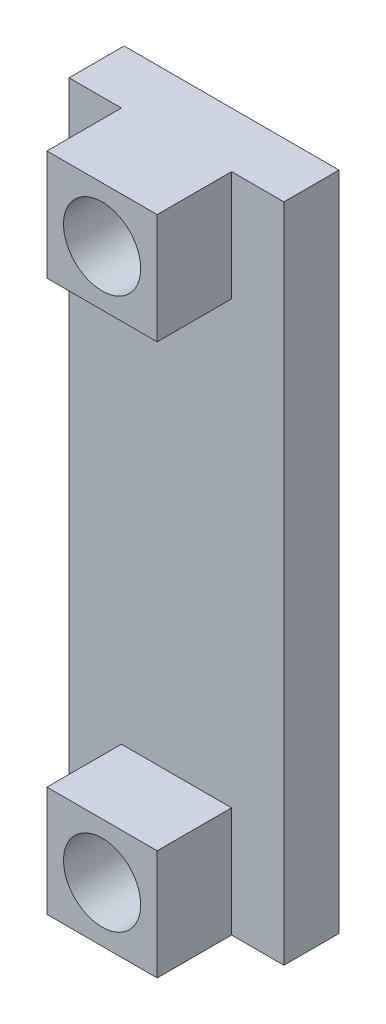
ISO-10303-21;
HEADER;
FILE_DESCRIPTION(('STEP AP214'),'2;1');
FILE_NAME('part.step','',(''),(''),'','','');
FILE_SCHEMA(('AUTOMOTIVE_DESIGN { 1 0 10303 214 1 1 1 1 }'));
ENDSEC;
DATA;
#1=APPLICATION_CONTEXT('core data for automotive mechanical design processes');
#2=APPLICATION_PROTOCOL_DEFINITION('international standard','automotive_design',2000,#1);
#3=PRODUCT_CONTEXT('',#1,'mechanical');
#4=PRODUCT('Part','Part','',(#3));
#5=PRODUCT_RELATED_PRODUCT_CATEGORY('part','',(#4));
#6=PRODUCT_DEFINITION_FORMATION('','',#4);
#7=PRODUCT_DEFINITION_CONTEXT('part definition',#1,'design');
#8=PRODUCT_DEFINITION('design','',#6,#7);
#9=PRODUCT_DEFINITION_SHAPE('','',#8);
#10=(LENGTH_UNIT() NAMED_UNIT(*) SI_UNIT(.MILLI.,.METRE.));
#11=(NAMED_UNIT(*) PLANE_ANGLE_UNIT() SI_UNIT($,.RADIAN.));
#12=(NAMED_UNIT(*) SI_UNIT($,.STERADIAN.) SOLID_ANGLE_UNIT());
#13=UNCERTAINTY_MEASURE_WITH_UNIT(LENGTH_MEASURE(1.E-05),#10,'distance_accuracy_value','');
#14=(GEOMETRIC_REPRESENTATION_CONTEXT(3) GLOBAL_UNCERTAINTY_ASSIGNED_CONTEXT((#13)) GLOBAL_UNIT_ASSIGNED_CONTEXT((#10,
#11,#12)) REPRESENTATION_CONTEXT('',''));
#15=CARTESIAN_POINT('',(0.,0.,0.));
#16=DIRECTION('',(0.,0.,1.));
#17=DIRECTION('',(1.,0.,0.));
#18=AXIS2_PLACEMENT_3D('',#15,#16,#17);
#19=CARTESIAN_POINT('',(0.,0.,2.54));
#20=DIRECTION('',(0.,0.,-1.));
#21=DIRECTION('',(-1.,0.,0.));
#22=AXIS2_PLACEMENT_3D('',#19,#20,#21);
#23=PLANE('',#22);
#24=DIRECTION('',(0.,-1.,0.));
#25=VECTOR('',#24,1.);
#26=CARTESIAN_POINT('',(-7.493,-30.48,2.54));
#27=LINE('',#26,#25);
#28=CARTESIAN_POINT('',(-7.493,-25.4,2.54));
#29=VERTEX_POINT('',#28);
#30=CARTESIAN_POINT('',(-7.493,-30.48,2.54));
#31=VERTEX_POINT('',#30);
#32=EDGE_CURVE('E50',#29,#31,#27,.T.);
#33=ORIENTED_EDGE('',*,*,#32,.F.);
#34=DIRECTION('',(-1.,0.,0.));
#35=VECTOR('',#34,1.);
#36=CARTESIAN_POINT('',(-7.493,-25.4,2.54));
#37=LINE('',#36,#35);
#38=CARTESIAN_POINT('',(-2.413,-25.4,2.54));
#39=VERTEX_POINT('',#38);
#40=EDGE_CURVE('E54',#39,#29,#37,.T.);
#41=ORIENTED_EDGE('',*,*,#40,.F.);
#42=DIRECTION('',(0.,1.,0.));
#43=VECTOR('',#42,1.);
#44=CARTESIAN_POINT('',(-2.413,-30.48,2.54));
#45=LINE('',#44,#43);
#46=CARTESIAN_POINT('',(-2.413,-30.48,2.54));
#47=VERTEX_POINT('',#46);
#48=EDGE_CURVE('E222',#47,#39,#45,.T.);
#49=ORIENTED_EDGE('',*,*,#48,.F.);
#50=DIRECTION('',(1.,0.,0.));
#51=VECTOR('',#50,1.);
#52=CARTESIAN_POINT('',(0.,-30.48,2.54));
#53=LINE('',#52,#51);
#54=CARTESIAN_POINT('',(0.,-30.48,2.54));
#55=VERTEX_POINT('',#54);
#56=EDGE_CURVE('E190',#47,#55,#53,.T.);
#57=ORIENTED_EDGE('',*,*,#56,.T.);
#58=DIRECTION('',(0.,1.,0.));
#59=VECTOR('',#58,1.);
#60=CARTESIAN_POINT('',(0.,0.,2.54));
#61=LINE('',#60,#59);
#62=CARTESIAN_POINT('',(0.,0.,2.54));
#63=VERTEX_POINT('',#62);
#64=EDGE_CURVE('E181',#55,#63,#61,.T.);
#65=ORIENTED_EDGE('',*,*,#64,.T.);
#66=DIRECTION('',(-1.,0.,0.));
#67=VECTOR('',#66,1.);
#68=CARTESIAN_POINT('',(0.,0.,2.54));
#69=LINE('',#68,#67);
#70=CARTESIAN_POINT('',(-2.413,0.,2.54));
#71=VERTEX_POINT('',#70);
#72=EDGE_CURVE('E186',#63,#71,#69,.T.);
#73=ORIENTED_EDGE('',*,*,#72,.T.);
#74=DIRECTION('',(0.,1.,0.));
#75=VECTOR('',#74,1.);
#76=CARTESIAN_POINT('',(-2.413,0.,2.54));
#77=LINE('',#76,#75);
#78=CARTESIAN_POINT('',(-2.413,-5.08,2.54));
#79=VERTEX_POINT('',#78);
#80=EDGE_CURVE('E158',#79,#71,#77,.T.);
#81=ORIENTED_EDGE('',*,*,#80,.F.);
#82=DIRECTION('',(1.,0.,0.));
#83=VECTOR('',#82,1.);
#84=CARTESIAN_POINT('',(-7.493,-5.08,2.54));
#85=LINE('',#84,#83);
#86=CARTESIAN_POINT('',(-7.493,-5.08,2.54));
#87=VERTEX_POINT('',#86);
#88=EDGE_CURVE('E148',#87,#79,#85,.T.);
#89=ORIENTED_EDGE('',*,*,#88,.F.);
#90=DIRECTION('',(0.,-1.,0.));
#91=VECTOR('',#90,1.);
#92=CARTESIAN_POINT('',(-7.493,0.,2.54));
#93=LINE('',#92,#91);
#94=CARTESIAN_POINT('',(-7.493,0.,2.54));
#95=VERTEX_POINT('',#94);
#96=EDGE_CURVE('E145',#95,#87,#93,.T.);
#97=ORIENTED_EDGE('',*,*,#96,.F.);
#98=CARTESIAN_POINT('',(-9.906,0.,2.54));
#99=VERTEX_POINT('',#98);
#100=EDGE_CURVE('E184',#95,#99,#69,.T.);
#101=ORIENTED_EDGE('',*,*,#100,.T.);
#102=DIRECTION('',(0.,-1.,0.));
#103=VECTOR('',#102,1.);
#104=CARTESIAN_POINT('',(-9.906,0.,2.54));
#105=LINE('',#104,#103);
#106=CARTESIAN_POINT('',(-9.906,-30.48,2.54));
#107=VERTEX_POINT('',#106);
#108=EDGE_CURVE('E188',#99,#107,#105,.T.);
#109=ORIENTED_EDGE('',*,*,#108,.T.);
#110=EDGE_CURVE('E191',#107,#31,#53,.T.);
#111=ORIENTED_EDGE('',*,*,#110,.T.);
#112=EDGE_LOOP('',(#33,#41,#49,#57,#65,#73,#81,#89,#97,#101,#109,#111));
#113=FACE_BOUND('',#112,.T.);
#114=ADVANCED_FACE('F35',(#113),#23,.F.);
#115=CARTESIAN_POINT('',(0.,0.,2.54));
#116=DIRECTION('',(-1.,0.,0.));
#117=DIRECTION('',(0.,-1.,0.));
#118=AXIS2_PLACEMENT_3D('',#115,#116,#117);
#119=PLANE('',#118);
#120=DIRECTION('',(0.,1.,0.));
#121=VECTOR('',#120,1.);
#122=CARTESIAN_POINT('',(0.,0.,0.));
#123=LINE('',#122,#121);
#124=CARTESIAN_POINT('',(0.,-30.48,0.));
#125=VERTEX_POINT('',#124);
#126=CARTESIAN_POINT('',(0.,0.,0.));
#127=VERTEX_POINT('',#126);
#128=EDGE_CURVE('E180',#125,#127,#123,.T.);
#129=ORIENTED_EDGE('',*,*,#128,.T.);
#130=DIRECTION('',(0.,0.,-1.));
#131=VECTOR('',#130,1.);
#132=CARTESIAN_POINT('',(0.,0.,2.54));
#133=LINE('',#132,#131);
#134=EDGE_CURVE('E11',#63,#127,#133,.T.);
#135=ORIENTED_EDGE('',*,*,#134,.F.);
#136=ORIENTED_EDGE('',*,*,#64,.F.);
#137=DIRECTION('',(0.,0.,-1.));
#138=VECTOR('',#137,1.);
#139=CARTESIAN_POINT('',(0.,-30.48,2.54));
#140=LINE('',#139,#138);
#141=EDGE_CURVE('E193',#55,#125,#140,.T.);
#142=ORIENTED_EDGE('',*,*,#141,.T.);
#143=EDGE_LOOP('',(#129,#135,#136,#142));
#144=FACE_BOUND('',#143,.T.);
#145=ADVANCED_FACE('F37',(#144),#119,.F.);
#146=CARTESIAN_POINT('',(0.,0.,2.54));
#147=DIRECTION('',(0.,-1.,0.));
#148=DIRECTION('',(0.,0.,-1.));
#149=AXIS2_PLACEMENT_3D('',#146,#147,#148);
#150=PLANE('',#149);
#151=DIRECTION('',(-1.,0.,0.));
#152=VECTOR('',#151,1.);
#153=CARTESIAN_POINT('',(0.,0.,0.));
#154=LINE('',#153,#152);
#155=CARTESIAN_POINT('',(-9.906,0.,0.));
#156=VERTEX_POINT('',#155);
#157=EDGE_CURVE('E196',#127,#156,#154,.T.);
#158=ORIENTED_EDGE('',*,*,#157,.T.);
#159=DIRECTION('',(0.,0.,-1.));
#160=VECTOR('',#159,1.);
#161=CARTESIAN_POINT('',(-9.906,0.,2.54));
#162=LINE('',#161,#160);
#163=EDGE_CURVE('E43',#99,#156,#162,.T.);
#164=ORIENTED_EDGE('',*,*,#163,.F.);
#165=ORIENTED_EDGE('',*,*,#100,.F.);
#166=DIRECTION('',(0.,0.,-1.));
#167=VECTOR('',#166,1.);
#168=CARTESIAN_POINT('',(-7.493,0.,5.969));
#169=LINE('',#168,#167);
#170=CARTESIAN_POINT('',(-7.493,0.,5.969));
#171=VERTEX_POINT('',#170);
#172=EDGE_CURVE('E163',#171,#95,#169,.T.);
#173=ORIENTED_EDGE('',*,*,#172,.F.);
#174=DIRECTION('',(-1.,0.,0.));
#175=VECTOR('',#174,1.);
#176=CARTESIAN_POINT('',(-7.493,0.,5.969));
#177=LINE('',#176,#175);
#178=CARTESIAN_POINT('',(-2.413,0.,5.969));
#179=VERTEX_POINT('',#178);
#180=EDGE_CURVE('E162',#179,#171,#177,.T.);
#181=ORIENTED_EDGE('',*,*,#180,.F.);
#182=DIRECTION('',(0.,0.,-1.));
#183=VECTOR('',#182,1.);
#184=CARTESIAN_POINT('',(-2.413,0.,5.969));
#185=LINE('',#184,#183);
#186=EDGE_CURVE('E171',#179,#71,#185,.T.);
#187=ORIENTED_EDGE('',*,*,#186,.T.);
#188=ORIENTED_EDGE('',*,*,#72,.F.);
#189=ORIENTED_EDGE('',*,*,#134,.T.);
#190=EDGE_LOOP('',(#158,#164,#165,#173,#181,#187,#188,#189));
#191=FACE_BOUND('',#190,.T.);
#192=ADVANCED_FACE('F252',(#191),#150,.F.);
#193=CARTESIAN_POINT('',(-9.906,0.,2.54));
#194=DIRECTION('',(1.,0.,0.));
#195=DIRECTION('',(0.,0.,-1.));
#196=AXIS2_PLACEMENT_3D('',#193,#194,#195);
#197=PLANE('',#196);
#198=DIRECTION('',(0.,-1.,0.));
#199=VECTOR('',#198,1.);
#200=CARTESIAN_POINT('',(-9.906,0.,0.));
#201=LINE('',#200,#199);
#202=CARTESIAN_POINT('',(-9.906,-30.48,0.));
#203=VERTEX_POINT('',#202);
#204=EDGE_CURVE('E198',#156,#203,#201,.T.);
#205=ORIENTED_EDGE('',*,*,#204,.T.);
#206=DIRECTION('',(0.,0.,-1.));
#207=VECTOR('',#206,1.);
#208=CARTESIAN_POINT('',(-9.906,-30.48,2.54));
#209=LINE('',#208,#207);
#210=EDGE_CURVE('E203',#107,#203,#209,.T.);
#211=ORIENTED_EDGE('',*,*,#210,.F.);
#212=ORIENTED_EDGE('',*,*,#108,.F.);
#213=ORIENTED_EDGE('',*,*,#163,.T.);
#214=EDGE_LOOP('',(#205,#211,#212,#213));
#215=FACE_BOUND('',#214,.T.);
#216=ADVANCED_FACE('F210',(#215),#197,.F.);
#217=CARTESIAN_POINT('',(0.,-30.48,2.54));
#218=DIRECTION('',(0.,1.,0.));
#219=DIRECTION('',(-1.,0.,0.));
#220=AXIS2_PLACEMENT_3D('',#217,#218,#219);
#221=PLANE('',#220);
#222=DIRECTION('',(1.,0.,0.));
#223=VECTOR('',#222,1.);
#224=CARTESIAN_POINT('',(0.,-30.48,0.));
#225=LINE('',#224,#223);
#226=EDGE_CURVE('E185',#203,#125,#225,.T.);
#227=ORIENTED_EDGE('',*,*,#226,.T.);
#228=ORIENTED_EDGE('',*,*,#141,.F.);
#229=ORIENTED_EDGE('',*,*,#56,.F.);
#230=DIRECTION('',(0.,0.,-1.));
#231=VECTOR('',#230,1.);
#232=CARTESIAN_POINT('',(-2.413,-30.48,5.969));
#233=LINE('',#232,#231);
#234=CARTESIAN_POINT('',(-2.413,-30.48,5.969));
#235=VERTEX_POINT('',#234);
#236=EDGE_CURVE('E130',#235,#47,#233,.T.);
#237=ORIENTED_EDGE('',*,*,#236,.F.);
#238=DIRECTION('',(1.,0.,0.));
#239=VECTOR('',#238,1.);
#240=CARTESIAN_POINT('',(-7.493,-30.48,5.969));
#241=LINE('',#240,#239);
#242=CARTESIAN_POINT('',(-7.493,-30.48,5.969));
#243=VERTEX_POINT('',#242);
#244=EDGE_CURVE('E123',#243,#235,#241,.T.);
#245=ORIENTED_EDGE('',*,*,#244,.F.);
#246=DIRECTION('',(0.,0.,-1.));
#247=VECTOR('',#246,1.);
#248=CARTESIAN_POINT('',(-7.493,-30.48,5.969));
#249=LINE('',#248,#247);
#250=EDGE_CURVE('E128',#243,#31,#249,.T.);
#251=ORIENTED_EDGE('',*,*,#250,.T.);
#252=ORIENTED_EDGE('',*,*,#110,.F.);
#253=ORIENTED_EDGE('',*,*,#210,.T.);
#254=EDGE_LOOP('',(#227,#228,#229,#237,#245,#251,#252,#253));
#255=FACE_BOUND('',#254,.T.);
#256=ADVANCED_FACE('F125',(#255),#221,.F.);
#257=CARTESIAN_POINT('',(0.,0.,0.));
#258=DIRECTION('',(0.,0.,-1.));
#259=DIRECTION('',(-1.,0.,0.));
#260=AXIS2_PLACEMENT_3D('',#257,#258,#259);
#261=PLANE('',#260);
#262=CARTESIAN_POINT('',(-4.953,-27.94,0.));
#263=DIRECTION('',(0.,0.,-1.));
#264=DIRECTION('',(-1.,0.,0.));
#265=AXIS2_PLACEMENT_3D('',#262,#263,#264);
#266=CIRCLE('',#265,1.778);
#267=CARTESIAN_POINT('',(-6.731,-27.94,0.));
#268=VERTEX_POINT('',#267);
#269=EDGE_CURVE('E393',#268,#268,#266,.T.);
#270=ORIENTED_EDGE('',*,*,#269,.F.);
#271=EDGE_LOOP('',(#270));
#272=FACE_BOUND('',#271,.T.);
#273=CARTESIAN_POINT('',(-4.953,-2.54,0.));
#274=DIRECTION('',(0.,0.,-1.));
#275=DIRECTION('',(-1.,0.,0.));
#276=AXIS2_PLACEMENT_3D('',#273,#274,#275);
#277=CIRCLE('',#276,1.778);
#278=CARTESIAN_POINT('',(-6.731,-2.54,0.));
#279=VERTEX_POINT('',#278);
#280=EDGE_CURVE('E232',#279,#279,#277,.T.);
#281=ORIENTED_EDGE('',*,*,#280,.F.);
#282=EDGE_LOOP('',(#281));
#283=FACE_BOUND('',#282,.T.);
#284=ORIENTED_EDGE('',*,*,#128,.F.);
#285=ORIENTED_EDGE('',*,*,#226,.F.);
#286=ORIENTED_EDGE('',*,*,#204,.F.);
#287=ORIENTED_EDGE('',*,*,#157,.F.);
#288=EDGE_LOOP('',(#284,#285,#286,#287));
#289=FACE_BOUND('',#288,.T.);
#290=ADVANCED_FACE('F217',(#272,#283,#289),#261,.T.);
#291=CARTESIAN_POINT('',(-7.493,0.,5.969));
#292=DIRECTION('',(1.,0.,0.));
#293=DIRECTION('',(0.,1.,0.));
#294=AXIS2_PLACEMENT_3D('',#291,#292,#293);
#295=PLANE('',#294);
#296=ORIENTED_EDGE('',*,*,#96,.T.);
#297=DIRECTION('',(0.,0.,-1.));
#298=VECTOR('',#297,1.);
#299=CARTESIAN_POINT('',(-7.493,-5.08,5.969));
#300=LINE('',#299,#298);
#301=CARTESIAN_POINT('',(-7.493,-5.08,5.969));
#302=VERTEX_POINT('',#301);
#303=EDGE_CURVE('E177',#302,#87,#300,.T.);
#304=ORIENTED_EDGE('',*,*,#303,.F.);
#305=DIRECTION('',(0.,-1.,0.));
#306=VECTOR('',#305,1.);
#307=CARTESIAN_POINT('',(-7.493,0.,5.969));
#308=LINE('',#307,#306);
#309=EDGE_CURVE('E154',#171,#302,#308,.T.);
#310=ORIENTED_EDGE('',*,*,#309,.F.);
#311=ORIENTED_EDGE('',*,*,#172,.T.);
#312=EDGE_LOOP('',(#296,#304,#310,#311));
#313=FACE_BOUND('',#312,.T.);
#314=ADVANCED_FACE('F255',(#313),#295,.F.);
#315=CARTESIAN_POINT('',(-7.493,-5.08,5.969));
#316=DIRECTION('',(0.,1.,0.));
#317=DIRECTION('',(0.,0.,1.));
#318=AXIS2_PLACEMENT_3D('',#315,#316,#317);
#319=PLANE('',#318);
#320=ORIENTED_EDGE('',*,*,#88,.T.);
#321=DIRECTION('',(0.,0.,-1.));
#322=VECTOR('',#321,1.);
#323=CARTESIAN_POINT('',(-2.413,-5.08,5.969));
#324=LINE('',#323,#322);
#325=CARTESIAN_POINT('',(-2.413,-5.08,5.969));
#326=VERTEX_POINT('',#325);
#327=EDGE_CURVE('E174',#326,#79,#324,.T.);
#328=ORIENTED_EDGE('',*,*,#327,.F.);
#329=DIRECTION('',(1.,0.,0.));
#330=VECTOR('',#329,1.);
#331=CARTESIAN_POINT('',(-7.493,-5.08,5.969));
#332=LINE('',#331,#330);
#333=EDGE_CURVE('E157',#302,#326,#332,.T.);
#334=ORIENTED_EDGE('',*,*,#333,.F.);
#335=ORIENTED_EDGE('',*,*,#303,.T.);
#336=EDGE_LOOP('',(#320,#328,#334,#335));
#337=FACE_BOUND('',#336,.T.);
#338=ADVANCED_FACE('F274',(#337),#319,.F.);
#339=CARTESIAN_POINT('',(-2.413,0.,5.969));
#340=DIRECTION('',(-1.,0.,0.));
#341=DIRECTION('',(0.,-1.,0.));
#342=AXIS2_PLACEMENT_3D('',#339,#340,#341);
#343=PLANE('',#342);
#344=ORIENTED_EDGE('',*,*,#80,.T.);
#345=ORIENTED_EDGE('',*,*,#186,.F.);
#346=DIRECTION('',(0.,1.,0.));
#347=VECTOR('',#346,1.);
#348=CARTESIAN_POINT('',(-2.413,0.,5.969));
#349=LINE('',#348,#347);
#350=EDGE_CURVE('E160',#326,#179,#349,.T.);
#351=ORIENTED_EDGE('',*,*,#350,.F.);
#352=ORIENTED_EDGE('',*,*,#327,.T.);
#353=EDGE_LOOP('',(#344,#345,#351,#352));
#354=FACE_BOUND('',#353,.T.);
#355=ADVANCED_FACE('F271',(#354),#343,.F.);
#356=CARTESIAN_POINT('',(0.,0.,5.969));
#357=DIRECTION('',(0.,0.,1.));
#358=DIRECTION('',(1.,0.,0.));
#359=AXIS2_PLACEMENT_3D('',#356,#357,#358);
#360=PLANE('',#359);
#361=CARTESIAN_POINT('',(-4.953,-2.54,5.969));
#362=DIRECTION('',(0.,0.,1.));
#363=DIRECTION('',(1.,0.,0.));
#364=AXIS2_PLACEMENT_3D('',#361,#362,#363);
#365=CIRCLE('',#364,1.778);
#366=CARTESIAN_POINT('',(-3.175,-2.54,5.969));
#367=VERTEX_POINT('',#366);
#368=EDGE_CURVE('E389',#367,#367,#365,.T.);
#369=ORIENTED_EDGE('',*,*,#368,.F.);
#370=EDGE_LOOP('',(#369));
#371=FACE_BOUND('',#370,.T.);
#372=ORIENTED_EDGE('',*,*,#309,.T.);
#373=ORIENTED_EDGE('',*,*,#333,.T.);
#374=ORIENTED_EDGE('',*,*,#350,.T.);
#375=ORIENTED_EDGE('',*,*,#180,.T.);
#376=EDGE_LOOP('',(#372,#373,#374,#375));
#377=FACE_BOUND('',#376,.T.);
#378=ADVANCED_FACE('F279',(#371,#377),#360,.T.);
#379=CARTESIAN_POINT('',(-7.493,-30.48,5.969));
#380=DIRECTION('',(1.,0.,0.));
#381=DIRECTION('',(0.,0.,-1.));
#382=AXIS2_PLACEMENT_3D('',#379,#380,#381);
#383=PLANE('',#382);
#384=ORIENTED_EDGE('',*,*,#32,.T.);
#385=ORIENTED_EDGE('',*,*,#250,.F.);
#386=DIRECTION('',(0.,-1.,0.));
#387=VECTOR('',#386,1.);
#388=CARTESIAN_POINT('',(-7.493,-30.48,5.969));
#389=LINE('',#388,#387);
#390=CARTESIAN_POINT('',(-7.493,-25.4,5.969));
#391=VERTEX_POINT('',#390);
#392=EDGE_CURVE('E134',#391,#243,#389,.T.);
#393=ORIENTED_EDGE('',*,*,#392,.F.);
#394=DIRECTION('',(0.,0.,-1.));
#395=VECTOR('',#394,1.);
#396=CARTESIAN_POINT('',(-7.493,-25.4,5.969));
#397=LINE('',#396,#395);
#398=EDGE_CURVE('E229',#391,#29,#397,.T.);
#399=ORIENTED_EDGE('',*,*,#398,.T.);
#400=EDGE_LOOP('',(#384,#385,#393,#399));
#401=FACE_BOUND('',#400,.T.);
#402=ADVANCED_FACE('F144',(#401),#383,.F.);
#403=CARTESIAN_POINT('',(-2.413,-30.48,5.969));
#404=DIRECTION('',(-1.,0.,0.));
#405=DIRECTION('',(0.,0.,1.));
#406=AXIS2_PLACEMENT_3D('',#403,#404,#405);
#407=PLANE('',#406);
#408=ORIENTED_EDGE('',*,*,#48,.T.);
#409=DIRECTION('',(0.,0.,-1.));
#410=VECTOR('',#409,1.);
#411=CARTESIAN_POINT('',(-2.413,-25.4,5.969));
#412=LINE('',#411,#410);
#413=CARTESIAN_POINT('',(-2.413,-25.4,5.969));
#414=VERTEX_POINT('',#413);
#415=EDGE_CURVE('E150',#414,#39,#412,.T.);
#416=ORIENTED_EDGE('',*,*,#415,.F.);
#417=DIRECTION('',(0.,1.,0.));
#418=VECTOR('',#417,1.);
#419=CARTESIAN_POINT('',(-2.413,-30.48,5.969));
#420=LINE('',#419,#418);
#421=EDGE_CURVE('E133',#235,#414,#420,.T.);
#422=ORIENTED_EDGE('',*,*,#421,.F.);
#423=ORIENTED_EDGE('',*,*,#236,.T.);
#424=EDGE_LOOP('',(#408,#416,#422,#423));
#425=FACE_BOUND('',#424,.T.);
#426=ADVANCED_FACE('F227',(#425),#407,.F.);
#427=CARTESIAN_POINT('',(-7.493,-25.4,5.969));
#428=DIRECTION('',(0.,-1.,0.));
#429=DIRECTION('',(0.,0.,-1.));
#430=AXIS2_PLACEMENT_3D('',#427,#428,#429);
#431=PLANE('',#430);
#432=ORIENTED_EDGE('',*,*,#40,.T.);
#433=ORIENTED_EDGE('',*,*,#398,.F.);
#434=DIRECTION('',(-1.,0.,0.));
#435=VECTOR('',#434,1.);
#436=CARTESIAN_POINT('',(-7.493,-25.4,5.969));
#437=LINE('',#436,#435);
#438=EDGE_CURVE('E139',#414,#391,#437,.T.);
#439=ORIENTED_EDGE('',*,*,#438,.F.);
#440=ORIENTED_EDGE('',*,*,#415,.T.);
#441=EDGE_LOOP('',(#432,#433,#439,#440));
#442=FACE_BOUND('',#441,.T.);
#443=ADVANCED_FACE('F236',(#442),#431,.F.);
#444=CARTESIAN_POINT('',(0.,0.,5.969));
#445=DIRECTION('',(0.,0.,-1.));
#446=DIRECTION('',(-1.,0.,0.));
#447=AXIS2_PLACEMENT_3D('',#444,#445,#446);
#448=PLANE('',#447);
#449=CARTESIAN_POINT('',(-4.953,-27.94,5.969));
#450=DIRECTION('',(0.,0.,1.));
#451=DIRECTION('',(1.,0.,0.));
#452=AXIS2_PLACEMENT_3D('',#449,#450,#451);
#453=CIRCLE('',#452,1.778);
#454=CARTESIAN_POINT('',(-3.175,-27.94,5.969));
#455=VERTEX_POINT('',#454);
#456=EDGE_CURVE('E390',#455,#455,#453,.T.);
#457=ORIENTED_EDGE('',*,*,#456,.F.);
#458=EDGE_LOOP('',(#457));
#459=FACE_BOUND('',#458,.T.);
#460=ORIENTED_EDGE('',*,*,#392,.T.);
#461=ORIENTED_EDGE('',*,*,#244,.T.);
#462=ORIENTED_EDGE('',*,*,#421,.T.);
#463=ORIENTED_EDGE('',*,*,#438,.T.);
#464=EDGE_LOOP('',(#460,#461,#462,#463));
#465=FACE_BOUND('',#464,.T.);
#466=ADVANCED_FACE('F137',(#459,#465),#448,.F.);
#467=CARTESIAN_POINT('',(-4.953,-27.94,-6.731));
#468=DIRECTION('',(0.,0.,1.));
#469=DIRECTION('',(1.,0.,0.));
#470=AXIS2_PLACEMENT_3D('',#467,#468,#469);
#471=CYLINDRICAL_SURFACE('',#470,1.778);
#472=ORIENTED_EDGE('',*,*,#269,.T.);
#473=EDGE_LOOP('',(#472));
#474=FACE_BOUND('',#473,.T.);
#475=ORIENTED_EDGE('',*,*,#456,.T.);
#476=EDGE_LOOP('',(#475));
#477=FACE_BOUND('',#476,.T.);
#478=ADVANCED_FACE('F243',(#474,#477),#471,.F.);
#479=CARTESIAN_POINT('',(-4.953,-2.54,-6.731));
#480=DIRECTION('',(0.,0.,1.));
#481=DIRECTION('',(1.,0.,0.));
#482=AXIS2_PLACEMENT_3D('',#479,#480,#481);
#483=CYLINDRICAL_SURFACE('',#482,1.778);
#484=ORIENTED_EDGE('',*,*,#280,.T.);
#485=EDGE_LOOP('',(#484));
#486=FACE_BOUND('',#485,.T.);
#487=ORIENTED_EDGE('',*,*,#368,.T.);
#488=EDGE_LOOP('',(#487));
#489=FACE_BOUND('',#488,.T.);
#490=ADVANCED_FACE('F371',(#486,#489),#483,.F.);
#491=CLOSED_SHELL('',(#114,#145,#192,#216,#256,#290,#314,#338,#355,#378,#402,#426,#443,#466,
#478,#490));
#492=MANIFOLD_SOLID_BREP('B2',#491);
#493=ADVANCED_BREP_SHAPE_REPRESENTATION('',(#18,#492),#14);
#494=SHAPE_DEFINITION_REPRESENTATION(#9,#493);
ENDSEC;
END-ISO-10303-21;
